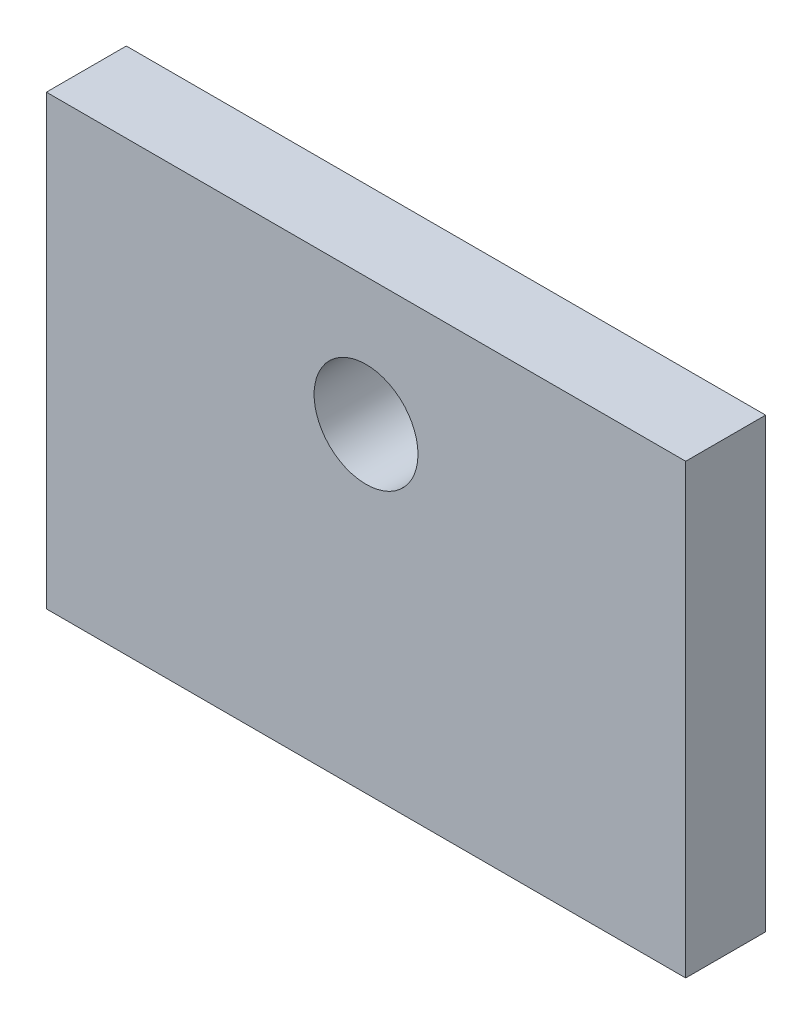
ISO-10303-21;
HEADER;
FILE_DESCRIPTION(('STEP AP214'),'2;1');
FILE_NAME('part.step','',(''),(''),'','','');
FILE_SCHEMA(('AUTOMOTIVE_DESIGN { 1 0 10303 214 1 1 1 1 }'));
ENDSEC;
DATA;
#1=APPLICATION_CONTEXT('core data for automotive mechanical design processes');
#2=APPLICATION_PROTOCOL_DEFINITION('international standard','automotive_design',2000,#1);
#3=PRODUCT_CONTEXT('',#1,'mechanical');
#4=PRODUCT('Part','Part','',(#3));
#5=PRODUCT_RELATED_PRODUCT_CATEGORY('part','',(#4));
#6=PRODUCT_DEFINITION_FORMATION('','',#4);
#7=PRODUCT_DEFINITION_CONTEXT('part definition',#1,'design');
#8=PRODUCT_DEFINITION('design','',#6,#7);
#9=PRODUCT_DEFINITION_SHAPE('','',#8);
#10=(LENGTH_UNIT() NAMED_UNIT(*) SI_UNIT(.MILLI.,.METRE.));
#11=(NAMED_UNIT(*) PLANE_ANGLE_UNIT() SI_UNIT($,.RADIAN.));
#12=(NAMED_UNIT(*) SI_UNIT($,.STERADIAN.) SOLID_ANGLE_UNIT());
#13=UNCERTAINTY_MEASURE_WITH_UNIT(LENGTH_MEASURE(1.E-05),#10,'distance_accuracy_value','');
#14=(GEOMETRIC_REPRESENTATION_CONTEXT(3) GLOBAL_UNCERTAINTY_ASSIGNED_CONTEXT((#13)) GLOBAL_UNIT_ASSIGNED_CONTEXT((#10,
#11,#12)) REPRESENTATION_CONTEXT('',''));
#15=CARTESIAN_POINT('',(0.,0.,0.));
#16=DIRECTION('',(0.,0.,1.));
#17=DIRECTION('',(1.,0.,0.));
#18=AXIS2_PLACEMENT_3D('',#15,#16,#17);
#19=CARTESIAN_POINT('',(0.,0.,10.));
#20=DIRECTION('',(0.,0.,1.));
#21=DIRECTION('',(1.,0.,0.));
#22=AXIS2_PLACEMENT_3D('',#19,#20,#21);
#23=PLANE('',#22);
#24=DIRECTION('',(0.,-1.,0.));
#25=VECTOR('',#24,1.);
#26=CARTESIAN_POINT('',(-36.1128526645768,28.58934169279,10.));
#27=LINE('',#26,#25);
#28=CARTESIAN_POINT('',(-36.1128526645768,28.58934169279,10.));
#29=VERTEX_POINT('',#28);
#30=CARTESIAN_POINT('',(-36.1128526645768,-27.41065830721,10.));
#31=VERTEX_POINT('',#30);
#32=EDGE_CURVE('E86',#29,#31,#27,.T.);
#33=ORIENTED_EDGE('',*,*,#32,.T.);
#34=DIRECTION('',(1.,0.,0.));
#35=VECTOR('',#34,1.);
#36=CARTESIAN_POINT('',(-36.1128526645768,-27.41065830721,10.));
#37=LINE('',#36,#35);
#38=CARTESIAN_POINT('',(43.8871473354232,-27.41065830721,10.));
#39=VERTEX_POINT('',#38);
#40=EDGE_CURVE('E81',#31,#39,#37,.T.);
#41=ORIENTED_EDGE('',*,*,#40,.T.);
#42=DIRECTION('',(0.,1.,0.));
#43=VECTOR('',#42,1.);
#44=CARTESIAN_POINT('',(43.8871473354232,28.58934169279,10.));
#45=LINE('',#44,#43);
#46=CARTESIAN_POINT('',(43.8871473354232,28.58934169279,10.));
#47=VERTEX_POINT('',#46);
#48=EDGE_CURVE('E84',#39,#47,#45,.T.);
#49=ORIENTED_EDGE('',*,*,#48,.T.);
#50=DIRECTION('',(-1.,0.,0.));
#51=VECTOR('',#50,1.);
#52=CARTESIAN_POINT('',(-36.1128526645768,28.58934169279,10.));
#53=LINE('',#52,#51);
#54=EDGE_CURVE('E51',#47,#29,#53,.T.);
#55=ORIENTED_EDGE('',*,*,#54,.T.);
#56=EDGE_LOOP('',(#33,#41,#49,#55));
#57=FACE_BOUND('',#56,.T.);
#58=CARTESIAN_POINT('',(3.8871473354232,12.58934169279,10.));
#59=DIRECTION('',(0.,0.,1.));
#60=DIRECTION('',(1.,0.,0.));
#61=AXIS2_PLACEMENT_3D('',#58,#59,#60);
#62=CIRCLE('',#61,6.5);
#63=CARTESIAN_POINT('',(10.3871473354232,12.58934169279,10.));
#64=VERTEX_POINT('',#63);
#65=EDGE_CURVE('E101',#64,#64,#62,.T.);
#66=ORIENTED_EDGE('',*,*,#65,.F.);
#67=EDGE_LOOP('',(#66));
#68=FACE_BOUND('',#67,.T.);
#69=ADVANCED_FACE('F34',(#57,#68),#23,.T.);
#70=CARTESIAN_POINT('',(0.,0.,0.));
#71=DIRECTION('',(0.,0.,1.));
#72=DIRECTION('',(1.,0.,0.));
#73=AXIS2_PLACEMENT_3D('',#70,#71,#72);
#74=PLANE('',#73);
#75=DIRECTION('',(0.,-1.,0.));
#76=VECTOR('',#75,1.);
#77=CARTESIAN_POINT('',(-36.1128526645768,28.58934169279,0.));
#78=LINE('',#77,#76);
#79=CARTESIAN_POINT('',(-36.1128526645768,28.58934169279,0.));
#80=VERTEX_POINT('',#79);
#81=CARTESIAN_POINT('',(-36.1128526645768,-27.41065830721,0.));
#82=VERTEX_POINT('',#81);
#83=EDGE_CURVE('E98',#80,#82,#78,.T.);
#84=ORIENTED_EDGE('',*,*,#83,.F.);
#85=DIRECTION('',(-1.,0.,0.));
#86=VECTOR('',#85,1.);
#87=CARTESIAN_POINT('',(-36.1128526645768,28.58934169279,0.));
#88=LINE('',#87,#86);
#89=CARTESIAN_POINT('',(43.8871473354232,28.58934169279,0.));
#90=VERTEX_POINT('',#89);
#91=EDGE_CURVE('E74',#90,#80,#88,.T.);
#92=ORIENTED_EDGE('',*,*,#91,.F.);
#93=DIRECTION('',(0.,1.,0.));
#94=VECTOR('',#93,1.);
#95=CARTESIAN_POINT('',(43.8871473354232,28.58934169279,0.));
#96=LINE('',#95,#94);
#97=CARTESIAN_POINT('',(43.8871473354232,-27.41065830721,0.));
#98=VERTEX_POINT('',#97);
#99=EDGE_CURVE('E68',#98,#90,#96,.T.);
#100=ORIENTED_EDGE('',*,*,#99,.F.);
#101=DIRECTION('',(1.,0.,0.));
#102=VECTOR('',#101,1.);
#103=CARTESIAN_POINT('',(-36.1128526645768,-27.41065830721,0.));
#104=LINE('',#103,#102);
#105=EDGE_CURVE('E90',#82,#98,#104,.T.);
#106=ORIENTED_EDGE('',*,*,#105,.F.);
#107=EDGE_LOOP('',(#84,#92,#100,#106));
#108=FACE_BOUND('',#107,.T.);
#109=CARTESIAN_POINT('',(3.8871473354232,12.58934169279,0.));
#110=DIRECTION('',(0.,0.,1.));
#111=DIRECTION('',(1.,0.,0.));
#112=AXIS2_PLACEMENT_3D('',#109,#110,#111);
#113=CIRCLE('',#112,6.5);
#114=CARTESIAN_POINT('',(10.3871473354232,12.58934169279,0.));
#115=VERTEX_POINT('',#114);
#116=EDGE_CURVE('E113',#115,#115,#113,.T.);
#117=ORIENTED_EDGE('',*,*,#116,.T.);
#118=EDGE_LOOP('',(#117));
#119=FACE_BOUND('',#118,.T.);
#120=ADVANCED_FACE('F109',(#108,#119),#74,.F.);
#121=CARTESIAN_POINT('',(-36.1128526645768,28.58934169279,10.));
#122=DIRECTION('',(1.,0.,0.));
#123=DIRECTION('',(0.,0.,-1.));
#124=AXIS2_PLACEMENT_3D('',#121,#122,#123);
#125=PLANE('',#124);
#126=ORIENTED_EDGE('',*,*,#83,.T.);
#127=DIRECTION('',(0.,0.,-1.));
#128=VECTOR('',#127,1.);
#129=CARTESIAN_POINT('',(-36.1128526645768,-27.41065830721,10.));
#130=LINE('',#129,#128);
#131=EDGE_CURVE('E11',#31,#82,#130,.T.);
#132=ORIENTED_EDGE('',*,*,#131,.F.);
#133=ORIENTED_EDGE('',*,*,#32,.F.);
#134=DIRECTION('',(0.,0.,-1.));
#135=VECTOR('',#134,1.);
#136=CARTESIAN_POINT('',(-36.1128526645768,28.58934169279,10.));
#137=LINE('',#136,#135);
#138=EDGE_CURVE('E94',#29,#80,#137,.T.);
#139=ORIENTED_EDGE('',*,*,#138,.T.);
#140=EDGE_LOOP('',(#126,#132,#133,#139));
#141=FACE_BOUND('',#140,.T.);
#142=ADVANCED_FACE('F36',(#141),#125,.F.);
#143=CARTESIAN_POINT('',(-36.1128526645768,-27.41065830721,10.));
#144=DIRECTION('',(0.,1.,0.));
#145=DIRECTION('',(0.,0.,1.));
#146=AXIS2_PLACEMENT_3D('',#143,#144,#145);
#147=PLANE('',#146);
#148=ORIENTED_EDGE('',*,*,#105,.T.);
#149=DIRECTION('',(0.,0.,-1.));
#150=VECTOR('',#149,1.);
#151=CARTESIAN_POINT('',(43.8871473354232,-27.41065830721,10.));
#152=LINE('',#151,#150);
#153=EDGE_CURVE('E43',#39,#98,#152,.T.);
#154=ORIENTED_EDGE('',*,*,#153,.F.);
#155=ORIENTED_EDGE('',*,*,#40,.F.);
#156=ORIENTED_EDGE('',*,*,#131,.T.);
#157=EDGE_LOOP('',(#148,#154,#155,#156));
#158=FACE_BOUND('',#157,.T.);
#159=ADVANCED_FACE('F89',(#158),#147,.F.);
#160=CARTESIAN_POINT('',(43.8871473354232,28.58934169279,10.));
#161=DIRECTION('',(-1.,0.,0.));
#162=DIRECTION('',(0.,-1.,0.));
#163=AXIS2_PLACEMENT_3D('',#160,#161,#162);
#164=PLANE('',#163);
#165=ORIENTED_EDGE('',*,*,#99,.T.);
#166=DIRECTION('',(0.,0.,-1.));
#167=VECTOR('',#166,1.);
#168=CARTESIAN_POINT('',(43.8871473354232,28.58934169279,10.));
#169=LINE('',#168,#167);
#170=EDGE_CURVE('E91',#47,#90,#169,.T.);
#171=ORIENTED_EDGE('',*,*,#170,.F.);
#172=ORIENTED_EDGE('',*,*,#48,.F.);
#173=ORIENTED_EDGE('',*,*,#153,.T.);
#174=EDGE_LOOP('',(#165,#171,#172,#173));
#175=FACE_BOUND('',#174,.T.);
#176=ADVANCED_FACE('F92',(#175),#164,.F.);
#177=CARTESIAN_POINT('',(-36.1128526645768,28.58934169279,10.));
#178=DIRECTION('',(0.,-1.,0.));
#179=DIRECTION('',(0.,0.,-1.));
#180=AXIS2_PLACEMENT_3D('',#177,#178,#179);
#181=PLANE('',#180);
#182=ORIENTED_EDGE('',*,*,#91,.T.);
#183=ORIENTED_EDGE('',*,*,#138,.F.);
#184=ORIENTED_EDGE('',*,*,#54,.F.);
#185=ORIENTED_EDGE('',*,*,#170,.T.);
#186=EDGE_LOOP('',(#182,#183,#184,#185));
#187=FACE_BOUND('',#186,.T.);
#188=ADVANCED_FACE('F106',(#187),#181,.F.);
#189=CARTESIAN_POINT('',(3.8871473354232,12.58934169279,10.));
#190=DIRECTION('',(0.,0.,-1.));
#191=DIRECTION('',(-1.,0.,0.));
#192=AXIS2_PLACEMENT_3D('',#189,#190,#191);
#193=CYLINDRICAL_SURFACE('',#192,6.5);
#194=ORIENTED_EDGE('',*,*,#65,.T.);
#195=EDGE_LOOP('',(#194));
#196=FACE_BOUND('',#195,.T.);
#197=ORIENTED_EDGE('',*,*,#116,.F.);
#198=EDGE_LOOP('',(#197));
#199=FACE_BOUND('',#198,.T.);
#200=ADVANCED_FACE('F119',(#196,#199),#193,.F.);
#201=CLOSED_SHELL('',(#69,#120,#142,#159,#176,#188,#200));
#202=MANIFOLD_SOLID_BREP('B2',#201);
#203=ADVANCED_BREP_SHAPE_REPRESENTATION('',(#18,#202),#14);
#204=SHAPE_DEFINITION_REPRESENTATION(#9,#203);
ENDSEC;
END-ISO-10303-21;
